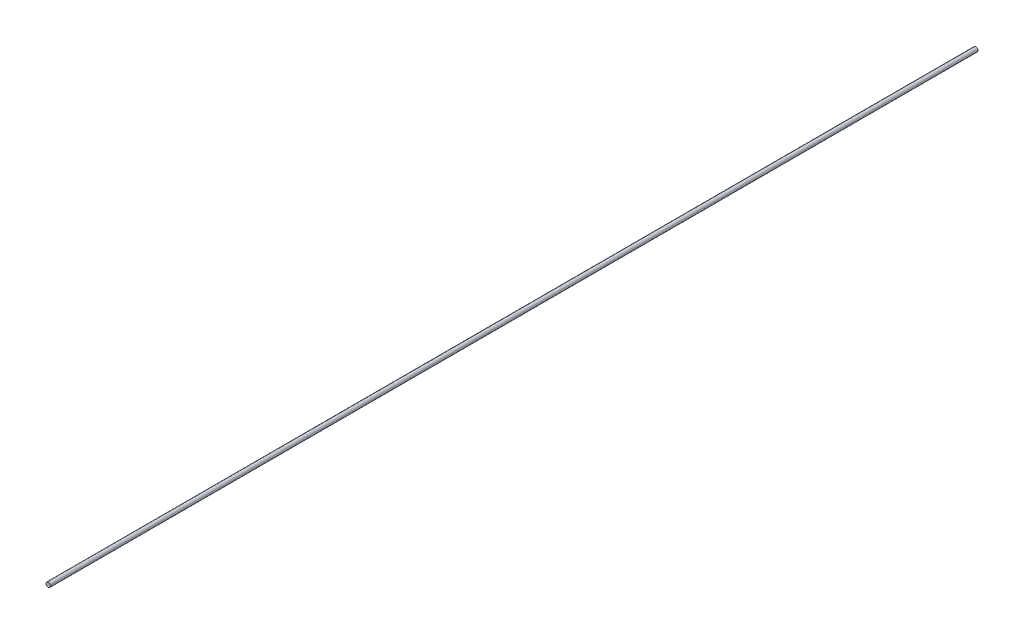
ISO-10303-21;
HEADER;
FILE_DESCRIPTION(('STEP AP214'),'2;1');
FILE_NAME('part.step','',(''),(''),'','','');
FILE_SCHEMA(('AUTOMOTIVE_DESIGN { 1 0 10303 214 1 1 1 1 }'));
ENDSEC;
DATA;
#1=APPLICATION_CONTEXT('core data for automotive mechanical design processes');
#2=APPLICATION_PROTOCOL_DEFINITION('international standard','automotive_design',2000,#1);
#3=PRODUCT_CONTEXT('',#1,'mechanical');
#4=PRODUCT('Part','Part','',(#3));
#5=PRODUCT_RELATED_PRODUCT_CATEGORY('part','',(#4));
#6=PRODUCT_DEFINITION_FORMATION('','',#4);
#7=PRODUCT_DEFINITION_CONTEXT('part definition',#1,'design');
#8=PRODUCT_DEFINITION('design','',#6,#7);
#9=PRODUCT_DEFINITION_SHAPE('','',#8);
#10=(LENGTH_UNIT() NAMED_UNIT(*) SI_UNIT(.MILLI.,.METRE.));
#11=(NAMED_UNIT(*) PLANE_ANGLE_UNIT() SI_UNIT($,.RADIAN.));
#12=(NAMED_UNIT(*) SI_UNIT($,.STERADIAN.) SOLID_ANGLE_UNIT());
#13=UNCERTAINTY_MEASURE_WITH_UNIT(LENGTH_MEASURE(1.E-05),#10,'distance_accuracy_value','');
#14=(GEOMETRIC_REPRESENTATION_CONTEXT(3) GLOBAL_UNCERTAINTY_ASSIGNED_CONTEXT((#13)) GLOBAL_UNIT_ASSIGNED_CONTEXT((#10,
#11,#12)) REPRESENTATION_CONTEXT('',''));
#15=CARTESIAN_POINT('',(0.,0.,0.));
#16=DIRECTION('',(0.,0.,1.));
#17=DIRECTION('',(1.,0.,0.));
#18=AXIS2_PLACEMENT_3D('',#15,#16,#17);
#19=CARTESIAN_POINT('',(0.,0.,1586.));
#20=DIRECTION('',(0.,0.,-1.));
#21=DIRECTION('',(-1.,0.,0.));
#22=AXIS2_PLACEMENT_3D('',#19,#20,#21);
#23=CYLINDRICAL_SURFACE('',#22,3.8);
#24=CARTESIAN_POINT('',(0.,0.,1586.));
#25=DIRECTION('',(0.,0.,1.));
#26=DIRECTION('',(1.,0.,0.));
#27=AXIS2_PLACEMENT_3D('',#24,#25,#26);
#28=CIRCLE('',#27,3.8);
#29=CARTESIAN_POINT('',(3.8,0.,1586.));
#30=VERTEX_POINT('',#29);
#31=EDGE_CURVE('E10',#30,#30,#28,.T.);
#32=ORIENTED_EDGE('',*,*,#31,.F.);
#33=EDGE_LOOP('',(#32));
#34=FACE_BOUND('',#33,.T.);
#35=CARTESIAN_POINT('',(0.,0.,0.));
#36=DIRECTION('',(0.,0.,1.));
#37=DIRECTION('',(1.,0.,0.));
#38=AXIS2_PLACEMENT_3D('',#35,#36,#37);
#39=CIRCLE('',#38,3.8);
#40=CARTESIAN_POINT('',(3.8,0.,0.));
#41=VERTEX_POINT('',#40);
#42=EDGE_CURVE('E37',#41,#41,#39,.T.);
#43=ORIENTED_EDGE('',*,*,#42,.T.);
#44=EDGE_LOOP('',(#43));
#45=FACE_BOUND('',#44,.T.);
#46=ADVANCED_FACE('F34',(#34,#45),#23,.T.);
#47=CARTESIAN_POINT('',(0.,0.,1586.));
#48=DIRECTION('',(0.,0.,1.));
#49=DIRECTION('',(1.,0.,0.));
#50=AXIS2_PLACEMENT_3D('',#47,#48,#49);
#51=PLANE('',#50);
#52=ORIENTED_EDGE('',*,*,#31,.T.);
#53=EDGE_LOOP('',(#52));
#54=FACE_BOUND('',#53,.T.);
#55=ADVANCED_FACE('F49',(#54),#51,.T.);
#56=CARTESIAN_POINT('',(0.,0.,0.));
#57=DIRECTION('',(0.,0.,1.));
#58=DIRECTION('',(1.,0.,0.));
#59=AXIS2_PLACEMENT_3D('',#56,#57,#58);
#60=PLANE('',#59);
#61=ORIENTED_EDGE('',*,*,#42,.F.);
#62=EDGE_LOOP('',(#61));
#63=FACE_BOUND('',#62,.T.);
#64=ADVANCED_FACE('F47',(#63),#60,.F.);
#65=CLOSED_SHELL('',(#46,#55,#64));
#66=MANIFOLD_SOLID_BREP('B2',#65);
#67=ADVANCED_BREP_SHAPE_REPRESENTATION('',(#18,#66),#14);
#68=SHAPE_DEFINITION_REPRESENTATION(#9,#67);
ENDSEC;
END-ISO-10303-21;
